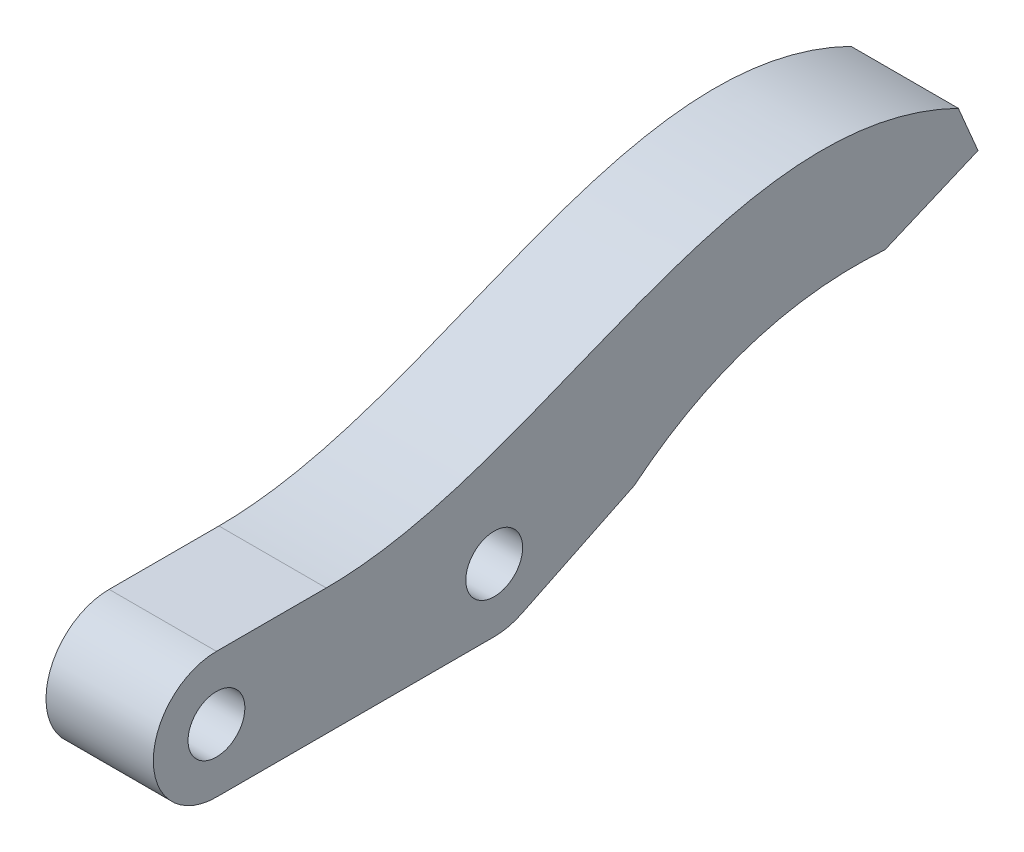
ISO-10303-21;
HEADER;
FILE_DESCRIPTION(('STEP AP214'),'2;1');
FILE_NAME('part.step','',(''),(''),'','','');
FILE_SCHEMA(('AUTOMOTIVE_DESIGN { 1 0 10303 214 1 1 1 1 }'));
ENDSEC;
DATA;
#1=APPLICATION_CONTEXT('core data for automotive mechanical design processes');
#2=APPLICATION_PROTOCOL_DEFINITION('international standard','automotive_design',2000,#1);
#3=PRODUCT_CONTEXT('',#1,'mechanical');
#4=PRODUCT('Part','Part','',(#3));
#5=PRODUCT_RELATED_PRODUCT_CATEGORY('part','',(#4));
#6=PRODUCT_DEFINITION_FORMATION('','',#4);
#7=PRODUCT_DEFINITION_CONTEXT('part definition',#1,'design');
#8=PRODUCT_DEFINITION('design','',#6,#7);
#9=PRODUCT_DEFINITION_SHAPE('','',#8);
#10=(LENGTH_UNIT() NAMED_UNIT(*) SI_UNIT(.MILLI.,.METRE.));
#11=(NAMED_UNIT(*) PLANE_ANGLE_UNIT() SI_UNIT($,.RADIAN.));
#12=(NAMED_UNIT(*) SI_UNIT($,.STERADIAN.) SOLID_ANGLE_UNIT());
#13=UNCERTAINTY_MEASURE_WITH_UNIT(LENGTH_MEASURE(1.E-05),#10,'distance_accuracy_value','');
#14=(GEOMETRIC_REPRESENTATION_CONTEXT(3) GLOBAL_UNCERTAINTY_ASSIGNED_CONTEXT((#13)) GLOBAL_UNIT_ASSIGNED_CONTEXT((#10,
#11,#12)) REPRESENTATION_CONTEXT('',''));
#15=CARTESIAN_POINT('',(0.,0.,0.));
#16=DIRECTION('',(0.,0.,1.));
#17=DIRECTION('',(1.,0.,0.));
#18=AXIS2_PLACEMENT_3D('',#15,#16,#17);
#19=CARTESIAN_POINT('',(8.5,5.,-27.));
#20=DIRECTION('',(-1.,0.,0.));
#21=DIRECTION('',(0.,0.,1.));
#22=AXIS2_PLACEMENT_3D('',#19,#20,#21);
#23=CYLINDRICAL_SURFACE('',#22,5.);
#24=DIRECTION('',(1.,0.,0.));
#25=VECTOR('',#24,1.);
#26=CARTESIAN_POINT('',(0.,0.502127655445501,-29.1838370754458));
#27=LINE('',#26,#25);
#28=CARTESIAN_POINT('',(0.,0.502127655445501,-29.1838370754458));
#29=VERTEX_POINT('',#28);
#30=CARTESIAN_POINT('',(8.5,0.502127655445501,-29.1838370754458));
#31=VERTEX_POINT('',#30);
#32=EDGE_CURVE('E193',#29,#31,#27,.T.);
#33=ORIENTED_EDGE('',*,*,#32,.T.);
#34=CARTESIAN_POINT('',(8.5,5.,-27.));
#35=DIRECTION('',(1.,0.,0.));
#36=DIRECTION('',(0.,0.,-1.));
#37=AXIS2_PLACEMENT_3D('',#34,#35,#36);
#38=CIRCLE('',#37,5.);
#39=CARTESIAN_POINT('',(8.5,0.,-27.));
#40=VERTEX_POINT('',#39);
#41=EDGE_CURVE('E205',#40,#31,#38,.T.);
#42=ORIENTED_EDGE('',*,*,#41,.F.);
#43=DIRECTION('',(-1.,0.,0.));
#44=VECTOR('',#43,1.);
#45=CARTESIAN_POINT('',(8.5,0.,-27.));
#46=LINE('',#45,#44);
#47=CARTESIAN_POINT('',(0.,0.,-27.));
#48=VERTEX_POINT('',#47);
#49=EDGE_CURVE('E213',#40,#48,#46,.T.);
#50=ORIENTED_EDGE('',*,*,#49,.T.);
#51=CARTESIAN_POINT('',(0.,5.,-27.));
#52=DIRECTION('',(1.,0.,0.));
#53=DIRECTION('',(0.,0.,-1.));
#54=AXIS2_PLACEMENT_3D('',#51,#52,#53);
#55=CIRCLE('',#54,5.);
#56=EDGE_CURVE('E217',#48,#29,#55,.T.);
#57=ORIENTED_EDGE('',*,*,#56,.T.);
#58=EDGE_LOOP('',(#33,#42,#50,#57));
#59=FACE_BOUND('',#58,.T.);
#60=ADVANCED_FACE('F38',(#59),#23,.T.);
#61=CARTESIAN_POINT('',(8.5,10.,0.));
#62=DIRECTION('',(0.,1.,0.));
#63=DIRECTION('',(0.,0.,1.));
#64=AXIS2_PLACEMENT_3D('',#61,#62,#63);
#65=PLANE('',#64);
#66=DIRECTION('',(1.,0.,0.));
#67=VECTOR('',#66,1.);
#68=CARTESIAN_POINT('',(0.,10.,-13.6949747586838));
#69=LINE('',#68,#67);
#70=CARTESIAN_POINT('',(0.,10.,-13.6949747586838));
#71=VERTEX_POINT('',#70);
#72=CARTESIAN_POINT('',(8.5,10.,-13.6949747586838));
#73=VERTEX_POINT('',#72);
#74=EDGE_CURVE('E128',#71,#73,#69,.T.);
#75=ORIENTED_EDGE('',*,*,#74,.F.);
#76=DIRECTION('',(0.,0.,-1.));
#77=VECTOR('',#76,1.);
#78=CARTESIAN_POINT('',(0.,10.,0.));
#79=LINE('',#78,#77);
#80=CARTESIAN_POINT('',(0.,10.,-5.));
#81=VERTEX_POINT('',#80);
#82=EDGE_CURVE('E139',#81,#71,#79,.T.);
#83=ORIENTED_EDGE('',*,*,#82,.F.);
#84=DIRECTION('',(-1.,0.,0.));
#85=VECTOR('',#84,1.);
#86=CARTESIAN_POINT('',(8.5,10.,-5.));
#87=LINE('',#86,#85);
#88=CARTESIAN_POINT('',(8.5,10.,-5.));
#89=VERTEX_POINT('',#88);
#90=EDGE_CURVE('E11',#89,#81,#87,.T.);
#91=ORIENTED_EDGE('',*,*,#90,.F.);
#92=DIRECTION('',(0.,0.,-1.));
#93=VECTOR('',#92,1.);
#94=CARTESIAN_POINT('',(8.5,10.,0.));
#95=LINE('',#94,#93);
#96=EDGE_CURVE('E192',#89,#73,#95,.T.);
#97=ORIENTED_EDGE('',*,*,#96,.T.);
#98=EDGE_LOOP('',(#75,#83,#91,#97));
#99=FACE_BOUND('',#98,.T.);
#100=ADVANCED_FACE('F40',(#99),#65,.T.);
#101=CARTESIAN_POINT('',(8.5,5.,-5.));
#102=DIRECTION('',(-1.,0.,0.));
#103=DIRECTION('',(0.,0.,1.));
#104=AXIS2_PLACEMENT_3D('',#101,#102,#103);
#105=CYLINDRICAL_SURFACE('',#104,5.);
#106=CARTESIAN_POINT('',(0.,5.,-5.));
#107=DIRECTION('',(1.,0.,0.));
#108=DIRECTION('',(0.,0.,-1.));
#109=AXIS2_PLACEMENT_3D('',#106,#107,#108);
#110=CIRCLE('',#109,5.);
#111=CARTESIAN_POINT('',(0.,0.,-5.));
#112=VERTEX_POINT('',#111);
#113=EDGE_CURVE('E68',#81,#112,#110,.T.);
#114=ORIENTED_EDGE('',*,*,#113,.T.);
#115=DIRECTION('',(-1.,0.,0.));
#116=VECTOR('',#115,1.);
#117=CARTESIAN_POINT('',(8.5,0.,-5.));
#118=LINE('',#117,#116);
#119=CARTESIAN_POINT('',(8.5,0.,-5.));
#120=VERTEX_POINT('',#119);
#121=EDGE_CURVE('E47',#120,#112,#118,.T.);
#122=ORIENTED_EDGE('',*,*,#121,.F.);
#123=CARTESIAN_POINT('',(8.5,5.,-5.));
#124=DIRECTION('',(1.,0.,0.));
#125=DIRECTION('',(0.,0.,-1.));
#126=AXIS2_PLACEMENT_3D('',#123,#124,#125);
#127=CIRCLE('',#126,5.);
#128=EDGE_CURVE('E201',#89,#120,#127,.T.);
#129=ORIENTED_EDGE('',*,*,#128,.F.);
#130=ORIENTED_EDGE('',*,*,#90,.T.);
#131=EDGE_LOOP('',(#114,#122,#129,#130));
#132=FACE_BOUND('',#131,.T.);
#133=ADVANCED_FACE('F184',(#132),#105,.T.);
#134=CARTESIAN_POINT('',(8.5,0.,0.));
#135=DIRECTION('',(0.,1.,0.));
#136=DIRECTION('',(0.,0.,1.));
#137=AXIS2_PLACEMENT_3D('',#134,#135,#136);
#138=PLANE('',#137);
#139=DIRECTION('',(0.,0.,-1.));
#140=VECTOR('',#139,1.);
#141=CARTESIAN_POINT('',(0.,0.,0.));
#142=LINE('',#141,#140);
#143=EDGE_CURVE('E73',#112,#48,#142,.T.);
#144=ORIENTED_EDGE('',*,*,#143,.T.);
#145=ORIENTED_EDGE('',*,*,#49,.F.);
#146=DIRECTION('',(0.,0.,-1.));
#147=VECTOR('',#146,1.);
#148=CARTESIAN_POINT('',(8.5,0.,0.));
#149=LINE('',#148,#147);
#150=EDGE_CURVE('E55',#120,#40,#149,.T.);
#151=ORIENTED_EDGE('',*,*,#150,.F.);
#152=ORIENTED_EDGE('',*,*,#121,.T.);
#153=EDGE_LOOP('',(#144,#145,#151,#152));
#154=FACE_BOUND('',#153,.T.);
#155=ADVANCED_FACE('F178',(#154),#138,.F.);
#156=CARTESIAN_POINT('',(8.5,5.,-5.));
#157=DIRECTION('',(-1.,0.,0.));
#158=DIRECTION('',(0.,0.,1.));
#159=AXIS2_PLACEMENT_3D('',#156,#157,#158);
#160=CYLINDRICAL_SURFACE('',#159,2.25);
#161=CARTESIAN_POINT('',(8.5,5.,-5.));
#162=DIRECTION('',(1.,0.,0.));
#163=DIRECTION('',(0.,0.,-1.));
#164=AXIS2_PLACEMENT_3D('',#161,#162,#163);
#165=CIRCLE('',#164,2.25);
#166=CARTESIAN_POINT('',(8.5,5.,-7.25));
#167=VERTEX_POINT('',#166);
#168=EDGE_CURVE('E207',#167,#167,#165,.T.);
#169=ORIENTED_EDGE('',*,*,#168,.T.);
#170=EDGE_LOOP('',(#169));
#171=FACE_BOUND('',#170,.T.);
#172=CARTESIAN_POINT('',(0.,5.,-5.));
#173=DIRECTION('',(1.,0.,0.));
#174=DIRECTION('',(0.,0.,-1.));
#175=AXIS2_PLACEMENT_3D('',#172,#173,#174);
#176=CIRCLE('',#175,2.25);
#177=CARTESIAN_POINT('',(0.,5.,-7.25));
#178=VERTEX_POINT('',#177);
#179=EDGE_CURVE('E220',#178,#178,#176,.T.);
#180=ORIENTED_EDGE('',*,*,#179,.F.);
#181=EDGE_LOOP('',(#180));
#182=FACE_BOUND('',#181,.T.);
#183=ADVANCED_FACE('F174',(#171,#182),#160,.F.);
#184=CARTESIAN_POINT('',(8.5,5.,-27.));
#185=DIRECTION('',(-1.,0.,0.));
#186=DIRECTION('',(0.,0.,1.));
#187=AXIS2_PLACEMENT_3D('',#184,#185,#186);
#188=CYLINDRICAL_SURFACE('',#187,2.25);
#189=CARTESIAN_POINT('',(8.5,5.,-27.));
#190=DIRECTION('',(1.,0.,0.));
#191=DIRECTION('',(0.,0.,-1.));
#192=AXIS2_PLACEMENT_3D('',#189,#190,#191);
#193=CIRCLE('',#192,2.25);
#194=CARTESIAN_POINT('',(8.5,5.,-29.25));
#195=VERTEX_POINT('',#194);
#196=EDGE_CURVE('E210',#195,#195,#193,.T.);
#197=ORIENTED_EDGE('',*,*,#196,.T.);
#198=EDGE_LOOP('',(#197));
#199=FACE_BOUND('',#198,.T.);
#200=CARTESIAN_POINT('',(0.,5.,-27.));
#201=DIRECTION('',(1.,0.,0.));
#202=DIRECTION('',(0.,0.,-1.));
#203=AXIS2_PLACEMENT_3D('',#200,#201,#202);
#204=CIRCLE('',#203,2.25);
#205=CARTESIAN_POINT('',(0.,5.,-29.25));
#206=VERTEX_POINT('',#205);
#207=EDGE_CURVE('E202',#206,#206,#204,.T.);
#208=ORIENTED_EDGE('',*,*,#207,.F.);
#209=EDGE_LOOP('',(#208));
#210=FACE_BOUND('',#209,.T.);
#211=ADVANCED_FACE('F169',(#199,#210),#188,.F.);
#212=CARTESIAN_POINT('',(8.5,0.,0.));
#213=DIRECTION('',(1.,0.,0.));
#214=DIRECTION('',(0.,0.,-1.));
#215=AXIS2_PLACEMENT_3D('',#212,#213,#214);
#216=PLANE('',#215);
#217=ORIENTED_EDGE('',*,*,#96,.F.);
#218=ORIENTED_EDGE('',*,*,#128,.T.);
#219=ORIENTED_EDGE('',*,*,#150,.T.);
#220=ORIENTED_EDGE('',*,*,#41,.T.);
#221=DIRECTION('',(0.,0.436767415089167,-0.8995744689109));
#222=VECTOR('',#221,1.);
#223=CARTESIAN_POINT('',(8.5,-11.0601312365663,-5.36998891997289));
#224=LINE('',#223,#222);
#225=CARTESIAN_POINT('',(8.5,4.82408407678908,-38.0854206599091));
#226=VERTEX_POINT('',#225);
#227=EDGE_CURVE('E233',#31,#226,#224,.T.);
#228=ORIENTED_EDGE('',*,*,#227,.T.);
#229=CARTESIAN_POINT('',(8.5,4.82408407678908,-38.0854206599091));
#230=CARTESIAN_POINT('',(8.5,11.8952224566425,-46.7975095094647));
#231=CARTESIAN_POINT('',(8.5,11.0678436667493,-57.9480004086976));
#232=B_SPLINE_CURVE_WITH_KNOTS('',2,(#229,#230,#231),.UNSPECIFIED.,.F.,.F.,(3,3),(0.,1.),.UNSPECIFIED.);
#233=CARTESIAN_POINT('',(8.5,11.0678436667493,-57.9480004086976));
#234=VERTEX_POINT('',#233);
#235=EDGE_CURVE('E147',#226,#234,#232,.T.);
#236=ORIENTED_EDGE('',*,*,#235,.T.);
#237=DIRECTION('',(0.,0.39020935118337,-0.920726160293631));
#238=VECTOR('',#237,1.);
#239=CARTESIAN_POINT('',(8.5,-11.4367064909869,-4.84694582599828));
#240=LINE('',#239,#238);
#241=CARTESIAN_POINT('',(8.5,14.1895184762162,-65.3138096910467));
#242=VERTEX_POINT('',#241);
#243=EDGE_CURVE('E144',#234,#242,#240,.T.);
#244=ORIENTED_EDGE('',*,*,#243,.T.);
#245=DIRECTION('',(0.,0.920726160293631,0.39020935118337));
#246=VECTOR('',#245,1.);
#247=CARTESIAN_POINT('',(8.5,25.6262249672031,-60.4668638650484));
#248=LINE('',#247,#246);
#249=CARTESIAN_POINT('',(8.5,17.8724231173908,-63.7529722863132));
#250=VERTEX_POINT('',#249);
#251=EDGE_CURVE('E239',#242,#250,#248,.T.);
#252=ORIENTED_EDGE('',*,*,#251,.T.);
#253=CARTESIAN_POINT('',(8.5,17.8724231173908,-63.7529722863132));
#254=CARTESIAN_POINT('',(8.5,26.563787962677,-45.9288826779558));
#255=CARTESIAN_POINT('',(8.5,10.,-31.059268620705));
#256=CARTESIAN_POINT('',(8.5,10.,-13.6949747586838));
#257=B_SPLINE_CURVE_WITH_KNOTS('',3,(#253,#254,#255,#256),.UNSPECIFIED.,.F.,.F.,(4,4),(0.,1.),.UNSPECIFIED.);
#258=EDGE_CURVE('E123',#250,#73,#257,.T.);
#259=ORIENTED_EDGE('',*,*,#258,.T.);
#260=EDGE_LOOP('',(#217,#218,#219,#220,#228,#236,#244,#252,#259));
#261=FACE_BOUND('',#260,.T.);
#262=ORIENTED_EDGE('',*,*,#168,.F.);
#263=EDGE_LOOP('',(#262));
#264=FACE_BOUND('',#263,.T.);
#265=ORIENTED_EDGE('',*,*,#196,.F.);
#266=EDGE_LOOP('',(#265));
#267=FACE_BOUND('',#266,.T.);
#268=ADVANCED_FACE('F166',(#261,#264,#267),#216,.T.);
#269=CARTESIAN_POINT('',(0.,0.,0.));
#270=DIRECTION('',(1.,0.,0.));
#271=DIRECTION('',(0.,0.,-1.));
#272=AXIS2_PLACEMENT_3D('',#269,#270,#271);
#273=PLANE('',#272);
#274=ORIENTED_EDGE('',*,*,#82,.T.);
#275=CARTESIAN_POINT('',(0.,17.8724231173908,-63.7529722863132));
#276=CARTESIAN_POINT('',(0.,26.563787962677,-45.9288826779558));
#277=CARTESIAN_POINT('',(0.,10.,-31.059268620705));
#278=CARTESIAN_POINT('',(0.,10.,-13.6949747586838));
#279=B_SPLINE_CURVE_WITH_KNOTS('',3,(#275,#276,#277,#278),.UNSPECIFIED.,.F.,.F.,(4,4),(0.,1.),.UNSPECIFIED.);
#280=CARTESIAN_POINT('',(0.,17.8724231173908,-63.7529722863132));
#281=VERTEX_POINT('',#280);
#282=EDGE_CURVE('E120',#281,#71,#279,.T.);
#283=ORIENTED_EDGE('',*,*,#282,.F.);
#284=DIRECTION('',(0.,0.920726160293631,0.39020935118337));
#285=VECTOR('',#284,1.);
#286=CARTESIAN_POINT('',(0.,25.6262249672031,-60.4668638650484));
#287=LINE('',#286,#285);
#288=CARTESIAN_POINT('',(0.,14.1895184762162,-65.3138096910467));
#289=VERTEX_POINT('',#288);
#290=EDGE_CURVE('E137',#289,#281,#287,.T.);
#291=ORIENTED_EDGE('',*,*,#290,.F.);
#292=DIRECTION('',(0.,0.39020935118337,-0.920726160293631));
#293=VECTOR('',#292,1.);
#294=CARTESIAN_POINT('',(0.,-11.4367064909869,-4.84694582599828));
#295=LINE('',#294,#293);
#296=CARTESIAN_POINT('',(0.,11.0678436667493,-57.9480004086976));
#297=VERTEX_POINT('',#296);
#298=EDGE_CURVE('E129',#297,#289,#295,.T.);
#299=ORIENTED_EDGE('',*,*,#298,.F.);
#300=CARTESIAN_POINT('',(0.,4.82408407678908,-38.0854206599091));
#301=CARTESIAN_POINT('',(0.,11.8952224566425,-46.7975095094647));
#302=CARTESIAN_POINT('',(0.,11.0678436667493,-57.9480004086976));
#303=B_SPLINE_CURVE_WITH_KNOTS('',2,(#300,#301,#302),.UNSPECIFIED.,.F.,.F.,(3,3),(0.,1.),.UNSPECIFIED.);
#304=CARTESIAN_POINT('',(0.,4.82408407678908,-38.0854206599091));
#305=VERTEX_POINT('',#304);
#306=EDGE_CURVE('E255',#305,#297,#303,.T.);
#307=ORIENTED_EDGE('',*,*,#306,.F.);
#308=DIRECTION('',(0.,0.436767415089167,-0.8995744689109));
#309=VECTOR('',#308,1.);
#310=CARTESIAN_POINT('',(0.,-11.0601312365663,-5.36998891997289));
#311=LINE('',#310,#309);
#312=EDGE_CURVE('E140',#29,#305,#311,.T.);
#313=ORIENTED_EDGE('',*,*,#312,.F.);
#314=ORIENTED_EDGE('',*,*,#56,.F.);
#315=ORIENTED_EDGE('',*,*,#143,.F.);
#316=ORIENTED_EDGE('',*,*,#113,.F.);
#317=EDGE_LOOP('',(#274,#283,#291,#299,#307,#313,#314,#315,#316));
#318=FACE_BOUND('',#317,.T.);
#319=ORIENTED_EDGE('',*,*,#179,.T.);
#320=EDGE_LOOP('',(#319));
#321=FACE_BOUND('',#320,.T.);
#322=ORIENTED_EDGE('',*,*,#207,.T.);
#323=EDGE_LOOP('',(#322));
#324=FACE_BOUND('',#323,.T.);
#325=ADVANCED_FACE('F134',(#318,#321,#324),#273,.F.);
#326=CARTESIAN_POINT('',(0.,25.6262249672031,-60.4668638650484));
#327=DIRECTION('',(0.,0.39020935118337,-0.920726160293631));
#328=DIRECTION('',(0.,0.920726160293631,0.39020935118337));
#329=AXIS2_PLACEMENT_3D('',#326,#327,#328);
#330=PLANE('',#329);
#331=ORIENTED_EDGE('',*,*,#251,.F.);
#332=DIRECTION('',(1.,0.,0.));
#333=VECTOR('',#332,1.);
#334=CARTESIAN_POINT('',(0.,14.1895184762162,-65.3138096910467));
#335=LINE('',#334,#333);
#336=EDGE_CURVE('E143',#289,#242,#335,.T.);
#337=ORIENTED_EDGE('',*,*,#336,.F.);
#338=ORIENTED_EDGE('',*,*,#290,.T.);
#339=DIRECTION('',(1.,0.,0.));
#340=VECTOR('',#339,1.);
#341=CARTESIAN_POINT('',(0.,17.8724231173908,-63.7529722863132));
#342=LINE('',#341,#340);
#343=EDGE_CURVE('E117',#281,#250,#342,.T.);
#344=ORIENTED_EDGE('',*,*,#343,.T.);
#345=EDGE_LOOP('',(#331,#337,#338,#344));
#346=FACE_BOUND('',#345,.T.);
#347=ADVANCED_FACE('F142',(#346),#330,.T.);
#348=CARTESIAN_POINT('',(0.,-11.4367064909869,-4.84694582599828));
#349=DIRECTION('',(0.,-0.920726160293631,-0.39020935118337));
#350=DIRECTION('',(0.,0.39020935118337,-0.920726160293631));
#351=AXIS2_PLACEMENT_3D('',#348,#349,#350);
#352=PLANE('',#351);
#353=ORIENTED_EDGE('',*,*,#243,.F.);
#354=DIRECTION('',(1.,0.,0.));
#355=VECTOR('',#354,1.);
#356=CARTESIAN_POINT('',(0.,11.0678436667493,-57.9480004086976));
#357=LINE('',#356,#355);
#358=EDGE_CURVE('E251',#297,#234,#357,.T.);
#359=ORIENTED_EDGE('',*,*,#358,.F.);
#360=ORIENTED_EDGE('',*,*,#298,.T.);
#361=ORIENTED_EDGE('',*,*,#336,.T.);
#362=EDGE_LOOP('',(#353,#359,#360,#361));
#363=FACE_BOUND('',#362,.T.);
#364=ADVANCED_FACE('F165',(#363),#352,.T.);
#365=DIRECTION('',(1.,0.,0.));
#366=VECTOR('',#365,1.);
#367=SURFACE_OF_LINEAR_EXTRUSION('',#303,#366);
#368=ORIENTED_EDGE('',*,*,#235,.F.);
#369=DIRECTION('',(1.,0.,0.));
#370=VECTOR('',#369,1.);
#371=CARTESIAN_POINT('',(0.,4.82408407678908,-38.0854206599091));
#372=LINE('',#371,#370);
#373=EDGE_CURVE('E196',#305,#226,#372,.T.);
#374=ORIENTED_EDGE('',*,*,#373,.F.);
#375=ORIENTED_EDGE('',*,*,#306,.T.);
#376=ORIENTED_EDGE('',*,*,#358,.T.);
#377=EDGE_LOOP('',(#368,#374,#375,#376));
#378=FACE_BOUND('',#377,.T.);
#379=ADVANCED_FACE('F254',(#378),#367,.T.);
#380=CARTESIAN_POINT('',(0.,-11.0601312365663,-5.36998891997289));
#381=DIRECTION('',(0.,-0.8995744689109,-0.436767415089167));
#382=DIRECTION('',(0.,0.436767415089167,-0.8995744689109));
#383=AXIS2_PLACEMENT_3D('',#380,#381,#382);
#384=PLANE('',#383);
#385=ORIENTED_EDGE('',*,*,#227,.F.);
#386=ORIENTED_EDGE('',*,*,#32,.F.);
#387=ORIENTED_EDGE('',*,*,#312,.T.);
#388=ORIENTED_EDGE('',*,*,#373,.T.);
#389=EDGE_LOOP('',(#385,#386,#387,#388));
#390=FACE_BOUND('',#389,.T.);
#391=ADVANCED_FACE('F161',(#390),#384,.T.);
#392=DIRECTION('',(1.,0.,0.));
#393=VECTOR('',#392,1.);
#394=SURFACE_OF_LINEAR_EXTRUSION('',#279,#393);
#395=ORIENTED_EDGE('',*,*,#258,.F.);
#396=ORIENTED_EDGE('',*,*,#343,.F.);
#397=ORIENTED_EDGE('',*,*,#282,.T.);
#398=ORIENTED_EDGE('',*,*,#74,.T.);
#399=EDGE_LOOP('',(#395,#396,#397,#398));
#400=FACE_BOUND('',#399,.T.);
#401=ADVANCED_FACE('F119',(#400),#394,.T.);
#402=CLOSED_SHELL('',(#60,#100,#133,#155,#183,#211,#268,#325,#347,#364,#379,#391,#401));
#403=MANIFOLD_SOLID_BREP('B2',#402);
#404=ADVANCED_BREP_SHAPE_REPRESENTATION('',(#18,#403),#14);
#405=SHAPE_DEFINITION_REPRESENTATION(#9,#404);
ENDSEC;
END-ISO-10303-21;
